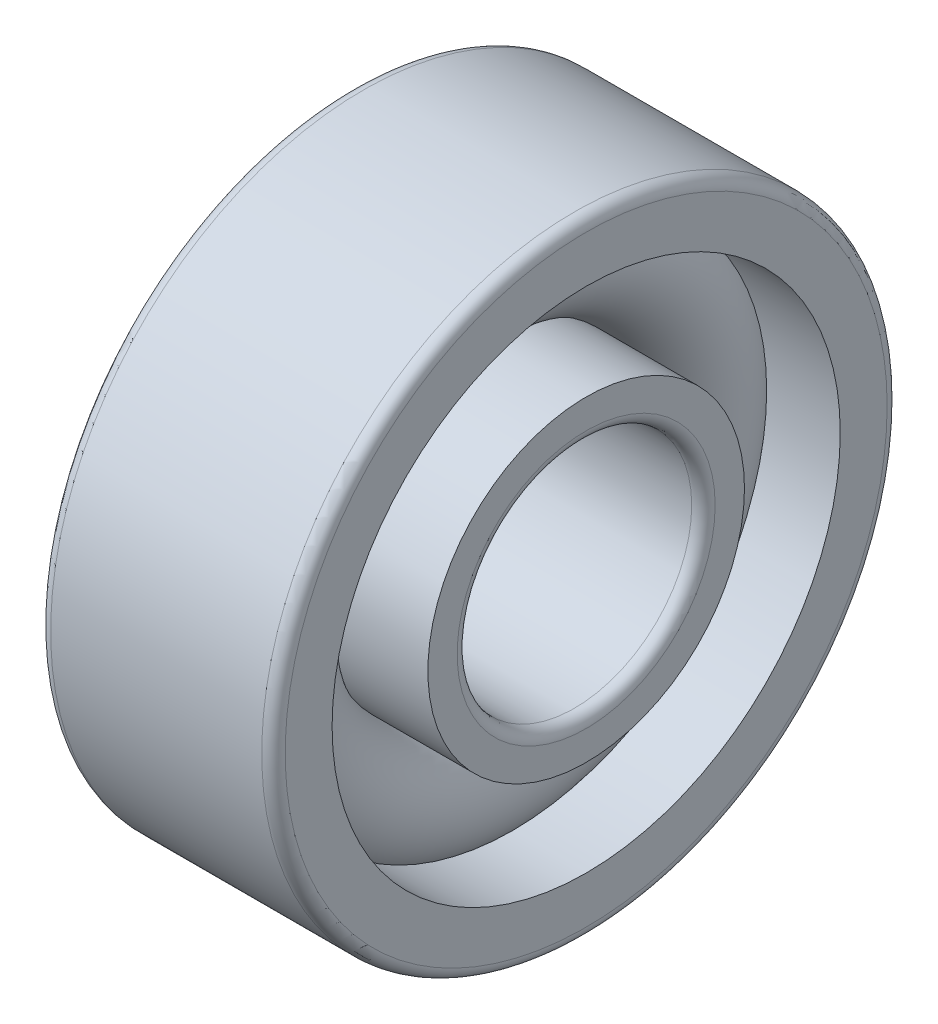
ISO-10303-21;
HEADER;
FILE_DESCRIPTION(('STEP AP214'),'2;1');
FILE_NAME('part.step','',(''),(''),'','','');
FILE_SCHEMA(('AUTOMOTIVE_DESIGN { 1 0 10303 214 1 1 1 1 }'));
ENDSEC;
DATA;
#1=APPLICATION_CONTEXT('core data for automotive mechanical design processes');
#2=APPLICATION_PROTOCOL_DEFINITION('international standard','automotive_design',2000,#1);
#3=PRODUCT_CONTEXT('',#1,'mechanical');
#4=PRODUCT('Part','Part','',(#3));
#5=PRODUCT_RELATED_PRODUCT_CATEGORY('part','',(#4));
#6=PRODUCT_DEFINITION_FORMATION('','',#4);
#7=PRODUCT_DEFINITION_CONTEXT('part definition',#1,'design');
#8=PRODUCT_DEFINITION('design','',#6,#7);
#9=PRODUCT_DEFINITION_SHAPE('','',#8);
#10=(LENGTH_UNIT() NAMED_UNIT(*) SI_UNIT(.MILLI.,.METRE.));
#11=(NAMED_UNIT(*) PLANE_ANGLE_UNIT() SI_UNIT($,.RADIAN.));
#12=(NAMED_UNIT(*) SI_UNIT($,.STERADIAN.) SOLID_ANGLE_UNIT());
#13=UNCERTAINTY_MEASURE_WITH_UNIT(LENGTH_MEASURE(1.E-05),#10,'distance_accuracy_value','');
#14=(GEOMETRIC_REPRESENTATION_CONTEXT(3) GLOBAL_UNCERTAINTY_ASSIGNED_CONTEXT((#13)) GLOBAL_UNIT_ASSIGNED_CONTEXT((#10,
#11,#12)) REPRESENTATION_CONTEXT('',''));
#15=CARTESIAN_POINT('',(0.,0.,0.));
#16=DIRECTION('',(0.,0.,1.));
#17=DIRECTION('',(1.,0.,0.));
#18=AXIS2_PLACEMENT_3D('',#15,#16,#17);
#19=CARTESIAN_POINT('',(0.,0.,0.));
#20=DIRECTION('',(-1.,0.,0.));
#21=DIRECTION('',(0.,0.,1.));
#22=AXIS2_PLACEMENT_3D('',#19,#20,#21);
#23=TOROIDAL_SURFACE('',#22,2.75,0.75);
#24=CARTESIAN_POINT('',(0.559016994374948,0.,0.));
#25=DIRECTION('',(-1.,0.,0.));
#26=DIRECTION('',(0.,0.,1.));
#27=AXIS2_PLACEMENT_3D('',#24,#25,#26);
#28=CIRCLE('',#27,3.25);
#29=CARTESIAN_POINT('',(0.559016994374948,0.,3.25));
#30=VERTEX_POINT('',#29);
#31=EDGE_CURVE('E35',#30,#30,#28,.F.);
#32=ORIENTED_EDGE('',*,*,#31,.T.);
#33=EDGE_LOOP('',(#32));
#34=FACE_BOUND('',#33,.T.);
#35=CARTESIAN_POINT('',(0.192028643696716,0.,0.));
#36=DIRECTION('',(-1.,0.,0.));
#37=DIRECTION('',(0.,0.,1.));
#38=AXIS2_PLACEMENT_3D('',#35,#36,#37);
#39=CIRCLE('',#38,2.025);
#40=CARTESIAN_POINT('',(0.192028643696716,0.,2.025));
#41=VERTEX_POINT('',#40);
#42=EDGE_CURVE('E10',#41,#41,#39,.T.);
#43=ORIENTED_EDGE('',*,*,#42,.T.);
#44=EDGE_LOOP('',(#43));
#45=FACE_BOUND('',#44,.T.);
#46=ADVANCED_FACE('F31',(#34,#45),#23,.T.);
#47=CARTESIAN_POINT('',(-20.6375,0.,0.));
#48=DIRECTION('',(1.,0.,0.));
#49=DIRECTION('',(0.,0.,-1.));
#50=AXIS2_PLACEMENT_3D('',#47,#48,#49);
#51=CYLINDRICAL_SURFACE('',#50,2.025);
#52=CARTESIAN_POINT('',(1.5,0.,0.));
#53=DIRECTION('',(1.,0.,0.));
#54=DIRECTION('',(0.,0.,-1.));
#55=AXIS2_PLACEMENT_3D('',#52,#53,#54);
#56=CIRCLE('',#55,2.025);
#57=CARTESIAN_POINT('',(1.5,0.,-2.025));
#58=VERTEX_POINT('',#57);
#59=EDGE_CURVE('E44',#58,#58,#56,.T.);
#60=ORIENTED_EDGE('',*,*,#59,.F.);
#61=EDGE_LOOP('',(#60));
#62=FACE_BOUND('',#61,.T.);
#63=ORIENTED_EDGE('',*,*,#42,.F.);
#64=EDGE_LOOP('',(#63));
#65=FACE_BOUND('',#64,.T.);
#66=ADVANCED_FACE('F83',(#62,#65),#51,.T.);
#67=CARTESIAN_POINT('',(-20.6375,0.,0.));
#68=DIRECTION('',(1.,0.,0.));
#69=DIRECTION('',(0.,0.,-1.));
#70=AXIS2_PLACEMENT_3D('',#67,#68,#69);
#71=CYLINDRICAL_SURFACE('',#70,2.25);
#72=CARTESIAN_POINT('',(-1.5,0.,0.));
#73=DIRECTION('',(1.,0.,0.));
#74=DIRECTION('',(0.,0.,-1.));
#75=AXIS2_PLACEMENT_3D('',#72,#73,#74);
#76=CIRCLE('',#75,2.25);
#77=CARTESIAN_POINT('',(-1.5,0.,-2.25));
#78=VERTEX_POINT('',#77);
#79=EDGE_CURVE('E53',#78,#78,#76,.T.);
#80=ORIENTED_EDGE('',*,*,#79,.T.);
#81=EDGE_LOOP('',(#80));
#82=FACE_BOUND('',#81,.T.);
#83=CARTESIAN_POINT('',(-0.559016994374948,0.,0.));
#84=DIRECTION('',(1.,0.,0.));
#85=DIRECTION('',(0.,0.,-1.));
#86=AXIS2_PLACEMENT_3D('',#83,#84,#85);
#87=CIRCLE('',#86,2.25);
#88=CARTESIAN_POINT('',(-0.559016994374948,0.,-2.25));
#89=VERTEX_POINT('',#88);
#90=EDGE_CURVE('E39',#89,#89,#87,.T.);
#91=ORIENTED_EDGE('',*,*,#90,.F.);
#92=EDGE_LOOP('',(#91));
#93=FACE_BOUND('',#92,.T.);
#94=ADVANCED_FACE('F86',(#82,#93),#71,.T.);
#95=CARTESIAN_POINT('',(1.5,1.65,0.));
#96=DIRECTION('',(1.,0.,0.));
#97=DIRECTION('',(0.,0.,-1.));
#98=AXIS2_PLACEMENT_3D('',#95,#96,#97);
#99=PLANE('',#98);
#100=ORIENTED_EDGE('',*,*,#59,.T.);
#101=EDGE_LOOP('',(#100));
#102=FACE_BOUND('',#101,.T.);
#103=CARTESIAN_POINT('',(1.5,0.,0.));
#104=DIRECTION('',(1.,0.,0.));
#105=DIRECTION('',(0.,0.,-1.));
#106=AXIS2_PLACEMENT_3D('',#103,#104,#105);
#107=CIRCLE('',#106,1.65);
#108=CARTESIAN_POINT('',(1.5,0.,-1.65));
#109=VERTEX_POINT('',#108);
#110=EDGE_CURVE('E75',#109,#109,#107,.T.);
#111=ORIENTED_EDGE('',*,*,#110,.F.);
#112=EDGE_LOOP('',(#111));
#113=FACE_BOUND('',#112,.T.);
#114=ADVANCED_FACE('F80',(#102,#113),#99,.T.);
#115=CARTESIAN_POINT('',(1.35,0.,0.));
#116=DIRECTION('',(1.,0.,0.));
#117=DIRECTION('',(0.,0.,-1.));
#118=AXIS2_PLACEMENT_3D('',#115,#116,#117);
#119=TOROIDAL_SURFACE('',#118,1.65,0.15);
#120=ORIENTED_EDGE('',*,*,#110,.T.);
#121=EDGE_LOOP('',(#120));
#122=FACE_BOUND('',#121,.T.);
#123=CARTESIAN_POINT('',(1.35,0.,0.));
#124=DIRECTION('',(1.,0.,0.));
#125=DIRECTION('',(0.,0.,-1.));
#126=AXIS2_PLACEMENT_3D('',#123,#124,#125);
#127=CIRCLE('',#126,1.5);
#128=CARTESIAN_POINT('',(1.35,0.,-1.5));
#129=VERTEX_POINT('',#128);
#130=EDGE_CURVE('E72',#129,#129,#127,.T.);
#131=ORIENTED_EDGE('',*,*,#130,.F.);
#132=EDGE_LOOP('',(#131));
#133=FACE_BOUND('',#132,.T.);
#134=ADVANCED_FACE('F97',(#122,#133),#119,.T.);
#135=CARTESIAN_POINT('',(-20.6375,0.,0.));
#136=DIRECTION('',(1.,0.,0.));
#137=DIRECTION('',(0.,0.,-1.));
#138=AXIS2_PLACEMENT_3D('',#135,#136,#137);
#139=CYLINDRICAL_SURFACE('',#138,1.5);
#140=ORIENTED_EDGE('',*,*,#130,.T.);
#141=EDGE_LOOP('',(#140));
#142=FACE_BOUND('',#141,.T.);
#143=CARTESIAN_POINT('',(-1.35,0.,0.));
#144=DIRECTION('',(1.,0.,0.));
#145=DIRECTION('',(0.,0.,-1.));
#146=AXIS2_PLACEMENT_3D('',#143,#144,#145);
#147=CIRCLE('',#146,1.5);
#148=CARTESIAN_POINT('',(-1.35,0.,-1.5));
#149=VERTEX_POINT('',#148);
#150=EDGE_CURVE('E69',#149,#149,#147,.T.);
#151=ORIENTED_EDGE('',*,*,#150,.F.);
#152=EDGE_LOOP('',(#151));
#153=FACE_BOUND('',#152,.T.);
#154=ADVANCED_FACE('F100',(#142,#153),#139,.F.);
#155=CARTESIAN_POINT('',(-1.35,0.,0.));
#156=DIRECTION('',(1.,0.,0.));
#157=DIRECTION('',(0.,0.,-1.));
#158=AXIS2_PLACEMENT_3D('',#155,#156,#157);
#159=TOROIDAL_SURFACE('',#158,1.65,0.15);
#160=ORIENTED_EDGE('',*,*,#150,.T.);
#161=EDGE_LOOP('',(#160));
#162=FACE_BOUND('',#161,.T.);
#163=CARTESIAN_POINT('',(-1.5,0.,0.));
#164=DIRECTION('',(1.,0.,0.));
#165=DIRECTION('',(0.,0.,-1.));
#166=AXIS2_PLACEMENT_3D('',#163,#164,#165);
#167=CIRCLE('',#166,1.65);
#168=CARTESIAN_POINT('',(-1.5,0.,-1.65));
#169=VERTEX_POINT('',#168);
#170=EDGE_CURVE('E66',#169,#169,#167,.T.);
#171=ORIENTED_EDGE('',*,*,#170,.F.);
#172=EDGE_LOOP('',(#171));
#173=FACE_BOUND('',#172,.T.);
#174=ADVANCED_FACE('F104',(#162,#173),#159,.T.);
#175=CARTESIAN_POINT('',(-1.5,2.25,0.));
#176=DIRECTION('',(-1.,0.,0.));
#177=DIRECTION('',(0.,0.,1.));
#178=AXIS2_PLACEMENT_3D('',#175,#176,#177);
#179=PLANE('',#178);
#180=ORIENTED_EDGE('',*,*,#170,.T.);
#181=EDGE_LOOP('',(#180));
#182=FACE_BOUND('',#181,.T.);
#183=ORIENTED_EDGE('',*,*,#79,.F.);
#184=EDGE_LOOP('',(#183));
#185=FACE_BOUND('',#184,.T.);
#186=ADVANCED_FACE('F108',(#182,#185),#179,.T.);
#187=CARTESIAN_POINT('',(-0.192028643696716,0.,0.));
#188=DIRECTION('',(1.,0.,0.));
#189=DIRECTION('',(0.,0.,-1.));
#190=AXIS2_PLACEMENT_3D('',#187,#188,#189);
#191=CIRCLE('',#190,3.475);
#192=CARTESIAN_POINT('',(-0.192028643696716,0.,-3.475));
#193=VERTEX_POINT('',#192);
#194=EDGE_CURVE('E47',#193,#193,#191,.F.);
#195=ORIENTED_EDGE('',*,*,#194,.T.);
#196=EDGE_LOOP('',(#195));
#197=FACE_BOUND('',#196,.T.);
#198=ORIENTED_EDGE('',*,*,#90,.T.);
#199=EDGE_LOOP('',(#198));
#200=FACE_BOUND('',#199,.T.);
#201=ADVANCED_FACE('F33',(#197,#200),#23,.T.);
#202=CARTESIAN_POINT('',(-20.6375,0.,0.));
#203=DIRECTION('',(1.,0.,0.));
#204=DIRECTION('',(0.,0.,-1.));
#205=AXIS2_PLACEMENT_3D('',#202,#203,#204);
#206=CYLINDRICAL_SURFACE('',#205,3.25);
#207=CARTESIAN_POINT('',(1.5,0.,0.));
#208=DIRECTION('',(1.,0.,0.));
#209=DIRECTION('',(0.,0.,-1.));
#210=AXIS2_PLACEMENT_3D('',#207,#208,#209);
#211=CIRCLE('',#210,3.25);
#212=CARTESIAN_POINT('',(1.5,0.,-3.25));
#213=VERTEX_POINT('',#212);
#214=EDGE_CURVE('E149',#213,#213,#211,.T.);
#215=ORIENTED_EDGE('',*,*,#214,.T.);
#216=EDGE_LOOP('',(#215));
#217=FACE_BOUND('',#216,.T.);
#218=ORIENTED_EDGE('',*,*,#31,.F.);
#219=EDGE_LOOP('',(#218));
#220=FACE_BOUND('',#219,.T.);
#221=ADVANCED_FACE('F130',(#217,#220),#206,.F.);
#222=CARTESIAN_POINT('',(-20.6375,0.,0.));
#223=DIRECTION('',(1.,0.,0.));
#224=DIRECTION('',(0.,0.,-1.));
#225=AXIS2_PLACEMENT_3D('',#222,#223,#224);
#226=CYLINDRICAL_SURFACE('',#225,3.475);
#227=CARTESIAN_POINT('',(-1.5,0.,0.));
#228=DIRECTION('',(1.,0.,0.));
#229=DIRECTION('',(0.,0.,-1.));
#230=AXIS2_PLACEMENT_3D('',#227,#228,#229);
#231=CIRCLE('',#230,3.475);
#232=CARTESIAN_POINT('',(-1.5,0.,-3.475));
#233=VERTEX_POINT('',#232);
#234=EDGE_CURVE('E144',#233,#233,#231,.T.);
#235=ORIENTED_EDGE('',*,*,#234,.F.);
#236=EDGE_LOOP('',(#235));
#237=FACE_BOUND('',#236,.T.);
#238=ORIENTED_EDGE('',*,*,#194,.F.);
#239=EDGE_LOOP('',(#238));
#240=FACE_BOUND('',#239,.T.);
#241=ADVANCED_FACE('F117',(#237,#240),#226,.F.);
#242=CARTESIAN_POINT('',(-1.35,0.,0.));
#243=DIRECTION('',(1.,0.,0.));
#244=DIRECTION('',(0.,0.,-1.));
#245=AXIS2_PLACEMENT_3D('',#242,#243,#244);
#246=TOROIDAL_SURFACE('',#245,3.85,0.15);
#247=CARTESIAN_POINT('',(-1.5,0.,0.));
#248=DIRECTION('',(1.,0.,0.));
#249=DIRECTION('',(0.,0.,-1.));
#250=AXIS2_PLACEMENT_3D('',#247,#248,#249);
#251=CIRCLE('',#250,3.85);
#252=CARTESIAN_POINT('',(-1.5,0.,-3.85));
#253=VERTEX_POINT('',#252);
#254=EDGE_CURVE('E147',#253,#253,#251,.T.);
#255=ORIENTED_EDGE('',*,*,#254,.T.);
#256=EDGE_LOOP('',(#255));
#257=FACE_BOUND('',#256,.T.);
#258=CARTESIAN_POINT('',(-1.35,0.,0.));
#259=DIRECTION('',(1.,0.,0.));
#260=DIRECTION('',(0.,0.,-1.));
#261=AXIS2_PLACEMENT_3D('',#258,#259,#260);
#262=CIRCLE('',#261,4.);
#263=CARTESIAN_POINT('',(-1.35,0.,-4.));
#264=VERTEX_POINT('',#263);
#265=EDGE_CURVE('E49',#264,#264,#262,.T.);
#266=ORIENTED_EDGE('',*,*,#265,.F.);
#267=EDGE_LOOP('',(#266));
#268=FACE_BOUND('',#267,.T.);
#269=ADVANCED_FACE('F113',(#257,#268),#246,.T.);
#270=CARTESIAN_POINT('',(-20.6375,0.,0.));
#271=DIRECTION('',(1.,0.,0.));
#272=DIRECTION('',(0.,0.,-1.));
#273=AXIS2_PLACEMENT_3D('',#270,#271,#272);
#274=CYLINDRICAL_SURFACE('',#273,4.);
#275=ORIENTED_EDGE('',*,*,#265,.T.);
#276=EDGE_LOOP('',(#275));
#277=FACE_BOUND('',#276,.T.);
#278=CARTESIAN_POINT('',(1.35,0.,0.));
#279=DIRECTION('',(1.,0.,0.));
#280=DIRECTION('',(0.,0.,-1.));
#281=AXIS2_PLACEMENT_3D('',#278,#279,#280);
#282=CIRCLE('',#281,4.);
#283=CARTESIAN_POINT('',(1.35,0.,-4.));
#284=VERTEX_POINT('',#283);
#285=EDGE_CURVE('E55',#284,#284,#282,.T.);
#286=ORIENTED_EDGE('',*,*,#285,.F.);
#287=EDGE_LOOP('',(#286));
#288=FACE_BOUND('',#287,.T.);
#289=ADVANCED_FACE('F116',(#277,#288),#274,.T.);
#290=CARTESIAN_POINT('',(1.35,0.,0.));
#291=DIRECTION('',(1.,0.,0.));
#292=DIRECTION('',(0.,0.,-1.));
#293=AXIS2_PLACEMENT_3D('',#290,#291,#292);
#294=TOROIDAL_SURFACE('',#293,3.85,0.15);
#295=ORIENTED_EDGE('',*,*,#285,.T.);
#296=EDGE_LOOP('',(#295));
#297=FACE_BOUND('',#296,.T.);
#298=CARTESIAN_POINT('',(1.5,0.,0.));
#299=DIRECTION('',(1.,0.,0.));
#300=DIRECTION('',(0.,0.,-1.));
#301=AXIS2_PLACEMENT_3D('',#298,#299,#300);
#302=CIRCLE('',#301,3.85);
#303=CARTESIAN_POINT('',(1.5,0.,-3.85));
#304=VERTEX_POINT('',#303);
#305=EDGE_CURVE('E60',#304,#304,#302,.T.);
#306=ORIENTED_EDGE('',*,*,#305,.F.);
#307=EDGE_LOOP('',(#306));
#308=FACE_BOUND('',#307,.T.);
#309=ADVANCED_FACE('F121',(#297,#308),#294,.T.);
#310=CARTESIAN_POINT('',(1.5,3.85,0.));
#311=DIRECTION('',(1.,0.,0.));
#312=DIRECTION('',(0.,0.,-1.));
#313=AXIS2_PLACEMENT_3D('',#310,#311,#312);
#314=PLANE('',#313);
#315=ORIENTED_EDGE('',*,*,#305,.T.);
#316=EDGE_LOOP('',(#315));
#317=FACE_BOUND('',#316,.T.);
#318=ORIENTED_EDGE('',*,*,#214,.F.);
#319=EDGE_LOOP('',(#318));
#320=FACE_BOUND('',#319,.T.);
#321=ADVANCED_FACE('F124',(#317,#320),#314,.T.);
#322=CARTESIAN_POINT('',(-1.5,3.475,0.));
#323=DIRECTION('',(-1.,0.,0.));
#324=DIRECTION('',(0.,0.,1.));
#325=AXIS2_PLACEMENT_3D('',#322,#323,#324);
#326=PLANE('',#325);
#327=ORIENTED_EDGE('',*,*,#234,.T.);
#328=EDGE_LOOP('',(#327));
#329=FACE_BOUND('',#328,.T.);
#330=ORIENTED_EDGE('',*,*,#254,.F.);
#331=EDGE_LOOP('',(#330));
#332=FACE_BOUND('',#331,.T.);
#333=ADVANCED_FACE('F128',(#329,#332),#326,.T.);
#334=CLOSED_SHELL('',(#46,#66,#94,#114,#134,#154,#174,#186,#201,#221,#241,#269,#289,#309,#321,#333));
#335=MANIFOLD_SOLID_BREP('B2',#334);
#336=ADVANCED_BREP_SHAPE_REPRESENTATION('',(#18,#335),#14);
#337=SHAPE_DEFINITION_REPRESENTATION(#9,#336);
ENDSEC;
END-ISO-10303-21;
